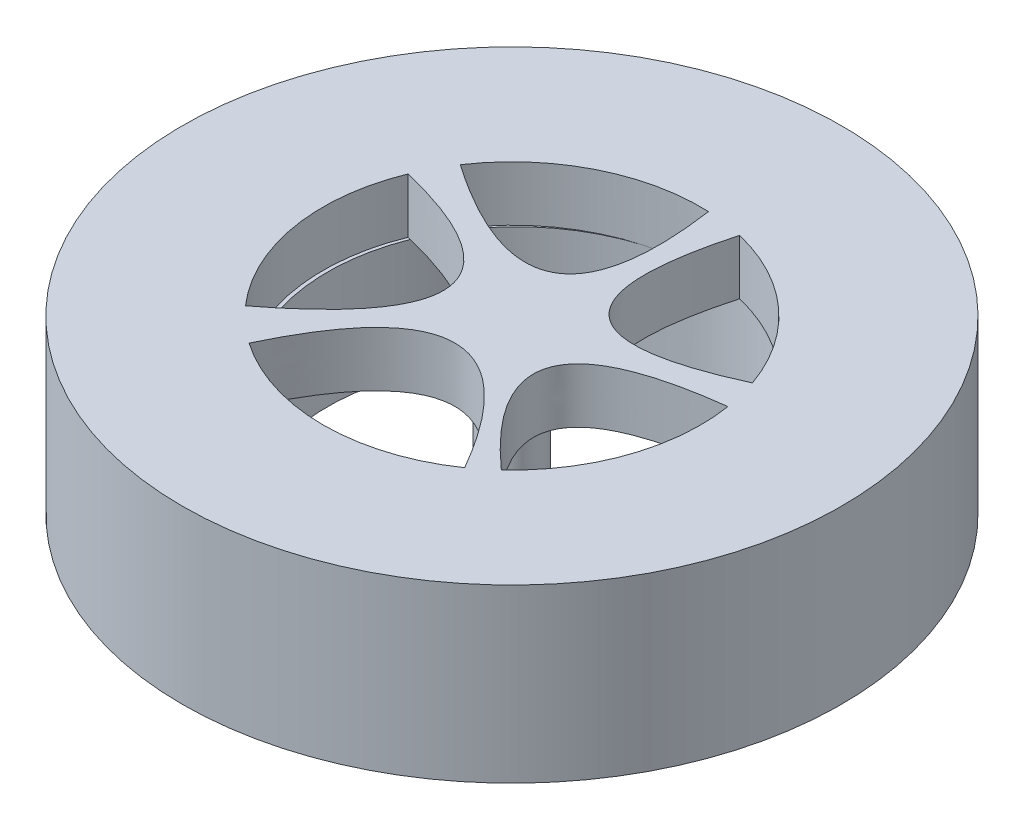
ISO-10303-21;
HEADER;
FILE_DESCRIPTION(('STEP AP214'),'2;1');
FILE_NAME('part.step','',(''),(''),'','','');
FILE_SCHEMA(('AUTOMOTIVE_DESIGN { 1 0 10303 214 1 1 1 1 }'));
ENDSEC;
DATA;
#1=APPLICATION_CONTEXT('core data for automotive mechanical design processes');
#2=APPLICATION_PROTOCOL_DEFINITION('international standard','automotive_design',2000,#1);
#3=PRODUCT_CONTEXT('',#1,'mechanical');
#4=PRODUCT('Part','Part','',(#3));
#5=PRODUCT_RELATED_PRODUCT_CATEGORY('part','',(#4));
#6=PRODUCT_DEFINITION_FORMATION('','',#4);
#7=PRODUCT_DEFINITION_CONTEXT('part definition',#1,'design');
#8=PRODUCT_DEFINITION('design','',#6,#7);
#9=PRODUCT_DEFINITION_SHAPE('','',#8);
#10=(LENGTH_UNIT() NAMED_UNIT(*) SI_UNIT(.MILLI.,.METRE.));
#11=(NAMED_UNIT(*) PLANE_ANGLE_UNIT() SI_UNIT($,.RADIAN.));
#12=(NAMED_UNIT(*) SI_UNIT($,.STERADIAN.) SOLID_ANGLE_UNIT());
#13=UNCERTAINTY_MEASURE_WITH_UNIT(LENGTH_MEASURE(1.E-05),#10,'distance_accuracy_value','');
#14=(GEOMETRIC_REPRESENTATION_CONTEXT(3) GLOBAL_UNCERTAINTY_ASSIGNED_CONTEXT((#13)) GLOBAL_UNIT_ASSIGNED_CONTEXT((#10,
#11,#12)) REPRESENTATION_CONTEXT('',''));
#15=CARTESIAN_POINT('',(0.,0.,0.));
#16=DIRECTION('',(0.,0.,1.));
#17=DIRECTION('',(1.,0.,0.));
#18=AXIS2_PLACEMENT_3D('',#15,#16,#17);
#19=CARTESIAN_POINT('',(-41.8687172900774,25.,-18.1249858398604));
#20=DIRECTION('',(0.,1.,0.));
#21=DIRECTION('',(0.,0.,1.));
#22=AXIS2_PLACEMENT_3D('',#19,#20,#21);
#23=PLANE('',#22);
#24=CARTESIAN_POINT('',(-57.5825730197563,25.,4.44323823973522));
#25=CARTESIAN_POINT('',(-43.3824366602649,25.,-25.570584631916));
#26=CARTESIAN_POINT('',(-26.1744695166798,25.,4.45687827334351));
#27=B_SPLINE_CURVE_WITH_KNOTS('',2,(#24,#25,#26),.UNSPECIFIED.,.F.,.F.,(3,3),(0.,1.),.UNSPECIFIED.);
#28=CARTESIAN_POINT('',(-57.5825730197563,25.,4.44323823973522));
#29=VERTEX_POINT('',#28);
#30=CARTESIAN_POINT('',(-26.1744695166798,25.,4.45687827334351));
#31=VERTEX_POINT('',#30);
#32=EDGE_CURVE('E60',#29,#31,#27,.T.);
#33=ORIENTED_EDGE('',*,*,#32,.T.);
#34=CARTESIAN_POINT('',(-41.8687172900774,25.,-18.1249858398604));
#35=DIRECTION('',(0.,-1.,0.));
#36=DIRECTION('',(0.,0.,-1.));
#37=AXIS2_PLACEMENT_3D('',#34,#35,#36);
#38=CIRCLE('',#37,27.5);
#39=EDGE_CURVE('E232',#31,#29,#38,.T.);
#40=ORIENTED_EDGE('',*,*,#39,.T.);
#41=EDGE_LOOP('',(#33,#40));
#42=FACE_BOUND('',#41,.T.);
#43=CARTESIAN_POINT('',(-67.3465288078325,25.,-28.4754022694415));
#44=CARTESIAN_POINT('',(-35.3604220946897,25.,-20.710055244798));
#45=CARTESIAN_POINT('',(-62.5504698344064,25.,0.));
#46=B_SPLINE_CURVE_WITH_KNOTS('',2,(#43,#44,#45),.UNSPECIFIED.,.F.,.F.,(3,3),(0.,1.),.UNSPECIFIED.);
#47=CARTESIAN_POINT('',(-67.3465288078325,25.,-28.4754022694415));
#48=VERTEX_POINT('',#47);
#49=CARTESIAN_POINT('',(-62.5504698344064,25.,0.));
#50=VERTEX_POINT('',#49);
#51=EDGE_CURVE('E68',#48,#50,#46,.T.);
#52=ORIENTED_EDGE('',*,*,#51,.T.);
#53=CARTESIAN_POINT('',(-41.8687172900774,25.,-18.1249858398604));
#54=DIRECTION('',(0.,-1.,0.));
#55=DIRECTION('',(0.,0.,-1.));
#56=AXIS2_PLACEMENT_3D('',#53,#54,#55);
#57=CIRCLE('',#56,27.5);
#58=EDGE_CURVE('E263',#50,#48,#57,.T.);
#59=ORIENTED_EDGE('',*,*,#58,.T.);
#60=EDGE_LOOP('',(#52,#59));
#61=FACE_BOUND('',#60,.T.);
#62=CARTESIAN_POINT('',(-15.9046301156076,25.,-27.1867835200413));
#63=CARTESIAN_POINT('',(-43.8764072157556,25.,-14.3288854530501));
#64=CARTESIAN_POINT('',(-35.4539369714029,25.,-44.8663506790593));
#65=B_SPLINE_CURVE_WITH_KNOTS('',2,(#62,#63,#64),.UNSPECIFIED.,.F.,.F.,(3,3),(0.,1.),.UNSPECIFIED.);
#66=CARTESIAN_POINT('',(-15.9046301156076,25.,-27.1867835200413));
#67=VERTEX_POINT('',#66);
#68=CARTESIAN_POINT('',(-35.4539369714029,25.,-44.8663506790593));
#69=VERTEX_POINT('',#68);
#70=EDGE_CURVE('E144',#67,#69,#65,.T.);
#71=ORIENTED_EDGE('',*,*,#70,.T.);
#72=CARTESIAN_POINT('',(-41.8687172900774,25.,-18.1249858398604));
#73=DIRECTION('',(0.,-1.,0.));
#74=DIRECTION('',(0.,0.,-1.));
#75=AXIS2_PLACEMENT_3D('',#72,#73,#74);
#76=CIRCLE('',#75,27.5);
#77=EDGE_CURVE('E153',#69,#67,#76,.T.);
#78=ORIENTED_EDGE('',*,*,#77,.T.);
#79=EDGE_LOOP('',(#71,#78));
#80=FACE_BOUND('',#79,.T.);
#81=CARTESIAN_POINT('',(-23.2105461945888,25.,2.07705988257761));
#82=CARTESIAN_POINT('',(-46.3557234271616,25.,-18.5464906730606));
#83=CARTESIAN_POINT('',(-14.7063699802523,25.,-22.4211339542111));
#84=B_SPLINE_CURVE_WITH_KNOTS('',2,(#81,#82,#83),.UNSPECIFIED.,.F.,.F.,(3,3),(0.,1.),.UNSPECIFIED.);
#85=CARTESIAN_POINT('',(-23.2105461945888,25.,2.07705988257762));
#86=VERTEX_POINT('',#85);
#87=CARTESIAN_POINT('',(-14.7063699802523,25.,-22.4211339542111));
#88=VERTEX_POINT('',#87);
#89=EDGE_CURVE('E193',#86,#88,#84,.T.);
#90=ORIENTED_EDGE('',*,*,#89,.T.);
#91=CARTESIAN_POINT('',(-41.8687172900774,25.,-18.1249858398604));
#92=DIRECTION('',(0.,-1.,0.));
#93=DIRECTION('',(0.,0.,-1.));
#94=AXIS2_PLACEMENT_3D('',#91,#92,#93);
#95=CIRCLE('',#94,27.5);
#96=EDGE_CURVE('E200',#88,#86,#95,.T.);
#97=ORIENTED_EDGE('',*,*,#96,.T.);
#98=EDGE_LOOP('',(#90,#97));
#99=FACE_BOUND('',#98,.T.);
#100=CARTESIAN_POINT('',(-40.7178815858433,25.,-45.6008948727178));
#101=CARTESIAN_POINT('',(-36.1565237836162,25.,-13.602103874753));
#102=CARTESIAN_POINT('',(-64.7073949398779,25.,-33.4431059336742));
#103=B_SPLINE_CURVE_WITH_KNOTS('',2,(#100,#101,#102),.UNSPECIFIED.,.F.,.F.,(3,3),(0.,1.),.UNSPECIFIED.);
#104=CARTESIAN_POINT('',(-40.7178815858433,25.,-45.6008948727178));
#105=VERTEX_POINT('',#104);
#106=CARTESIAN_POINT('',(-64.7073949398779,25.,-33.4431059336742));
#107=VERTEX_POINT('',#106);
#108=EDGE_CURVE('E293',#105,#107,#103,.T.);
#109=ORIENTED_EDGE('',*,*,#108,.T.);
#110=CARTESIAN_POINT('',(-41.8687172900774,25.,-18.1249858398604));
#111=DIRECTION('',(0.,-1.,0.));
#112=DIRECTION('',(0.,0.,-1.));
#113=AXIS2_PLACEMENT_3D('',#110,#111,#112);
#114=CIRCLE('',#113,27.5);
#115=EDGE_CURVE('E300',#107,#105,#114,.T.);
#116=ORIENTED_EDGE('',*,*,#115,.T.);
#117=EDGE_LOOP('',(#109,#116));
#118=FACE_BOUND('',#117,.T.);
#119=CARTESIAN_POINT('',(-41.8687172900774,25.,-18.1249858398604));
#120=DIRECTION('',(0.,1.,0.));
#121=DIRECTION('',(0.,0.,1.));
#122=AXIS2_PLACEMENT_3D('',#119,#120,#121);
#123=CIRCLE('',#122,48.);
#124=CARTESIAN_POINT('',(-41.8687172900774,25.,29.8750141601397));
#125=VERTEX_POINT('',#124);
#126=EDGE_CURVE('E396',#125,#125,#123,.T.);
#127=ORIENTED_EDGE('',*,*,#126,.T.);
#128=EDGE_LOOP('',(#127));
#129=FACE_BOUND('',#128,.T.);
#130=ADVANCED_FACE('F41',(#42,#61,#80,#99,#118,#129),#23,.T.);
#131=CARTESIAN_POINT('',(-41.8687172900774,0.,-18.1249858398604));
#132=DIRECTION('',(0.,1.,0.));
#133=DIRECTION('',(0.,0.,1.));
#134=AXIS2_PLACEMENT_3D('',#131,#132,#133);
#135=PLANE('',#134);
#136=CARTESIAN_POINT('',(-41.3457524589158,0.,-18.2744043630493));
#137=DIRECTION('',(0.,-1.,0.));
#138=DIRECTION('',(0.,0.,-1.));
#139=AXIS2_PLACEMENT_3D('',#136,#137,#138);
#140=CIRCLE('',#139,27.5);
#141=CARTESIAN_POINT('',(-41.3457524589158,0.,-45.7744043630493));
#142=VERTEX_POINT('',#141);
#143=EDGE_CURVE('E45',#142,#142,#140,.T.);
#144=ORIENTED_EDGE('',*,*,#143,.F.);
#145=EDGE_LOOP('',(#144));
#146=FACE_BOUND('',#145,.T.);
#147=CARTESIAN_POINT('',(-41.8687172900774,0.,-18.1249858398604));
#148=DIRECTION('',(0.,1.,0.));
#149=DIRECTION('',(0.,0.,1.));
#150=AXIS2_PLACEMENT_3D('',#147,#148,#149);
#151=CIRCLE('',#150,48.);
#152=CARTESIAN_POINT('',(-41.8687172900774,0.,29.8750141601397));
#153=VERTEX_POINT('',#152);
#154=EDGE_CURVE('E393',#153,#153,#151,.T.);
#155=ORIENTED_EDGE('',*,*,#154,.F.);
#156=EDGE_LOOP('',(#155));
#157=FACE_BOUND('',#156,.T.);
#158=ADVANCED_FACE('F43',(#146,#157),#135,.F.);
#159=CARTESIAN_POINT('',(-41.3457524589158,17.,-18.2744043630493));
#160=DIRECTION('',(0.,-1.,0.));
#161=DIRECTION('',(0.,0.,-1.));
#162=AXIS2_PLACEMENT_3D('',#159,#160,#161);
#163=CYLINDRICAL_SURFACE('',#162,27.5);
#164=CARTESIAN_POINT('',(-41.3457524589158,17.,-18.2744043630493));
#165=DIRECTION('',(0.,-1.,0.));
#166=DIRECTION('',(0.,0.,-1.));
#167=AXIS2_PLACEMENT_3D('',#164,#165,#166);
#168=CIRCLE('',#167,27.5);
#169=CARTESIAN_POINT('',(-34.0527732640102,17.,8.2409205352557));
#170=VERTEX_POINT('',#169);
#171=CARTESIAN_POINT('',(-57.3974563398632,17.,4.05478734911044));
#172=VERTEX_POINT('',#171);
#173=EDGE_CURVE('E355',#170,#172,#168,.T.);
#174=ORIENTED_EDGE('',*,*,#173,.F.);
#175=CARTESIAN_POINT('',(-49.1616964849826,17.,-44.6403107381655));
#176=VERTEX_POINT('',#175);
#177=EDGE_CURVE('E354',#176,#170,#168,.T.);
#178=ORIENTED_EDGE('',*,*,#177,.F.);
#179=CARTESIAN_POINT('',(-64.4160583896701,17.,-33.2414008640646));
#180=VERTEX_POINT('',#179);
#181=EDGE_CURVE('E351',#180,#176,#168,.T.);
#182=ORIENTED_EDGE('',*,*,#181,.F.);
#183=CARTESIAN_POINT('',(-66.9248817992793,17.,-28.37183681833));
#184=VERTEX_POINT('',#183);
#185=EDGE_CURVE('E338',#184,#180,#168,.T.);
#186=ORIENTED_EDGE('',*,*,#185,.F.);
#187=CARTESIAN_POINT('',(-62.1586347098584,17.,-0.300146870501505));
#188=VERTEX_POINT('',#187);
#189=EDGE_CURVE('E331',#188,#184,#168,.T.);
#190=ORIENTED_EDGE('',*,*,#189,.F.);
#191=EDGE_CURVE('E337',#172,#188,#168,.T.);
#192=ORIENTED_EDGE('',*,*,#191,.F.);
#193=EDGE_LOOP('',(#174,#178,#182,#186,#190,#192));
#194=FACE_BOUND('',#193,.T.);
#195=ORIENTED_EDGE('',*,*,#143,.T.);
#196=EDGE_LOOP('',(#195));
#197=FACE_BOUND('',#196,.T.);
#198=ADVANCED_FACE('F313',(#194,#197),#163,.F.);
#199=CARTESIAN_POINT('',(-41.3457524589158,17.,-18.2744043630493));
#200=DIRECTION('',(0.,-1.,0.));
#201=DIRECTION('',(0.,0.,-1.));
#202=AXIS2_PLACEMENT_3D('',#199,#200,#201);
#203=PLANE('',#202);
#204=CARTESIAN_POINT('',(-41.8687172900774,17.,-18.1249858398604));
#205=DIRECTION('',(0.,-1.,0.));
#206=DIRECTION('',(0.,0.,-1.));
#207=AXIS2_PLACEMENT_3D('',#204,#205,#206);
#208=CIRCLE('',#207,4.00000000000001);
#209=CARTESIAN_POINT('',(-41.8687172900774,17.,-22.1249858398604));
#210=VERTEX_POINT('',#209);
#211=EDGE_CURVE('E170',#210,#210,#208,.T.);
#212=ORIENTED_EDGE('',*,*,#211,.F.);
#213=EDGE_LOOP('',(#212));
#214=FACE_BOUND('',#213,.T.);
#215=CARTESIAN_POINT('',(-57.5825730197563,17.,4.44323823973522));
#216=CARTESIAN_POINT('',(-43.3824366602649,17.,-25.570584631916));
#217=CARTESIAN_POINT('',(-26.1744695166798,17.,4.45687827334351));
#218=B_SPLINE_CURVE_WITH_KNOTS('',2,(#215,#216,#217),.UNSPECIFIED.,.F.,.F.,(3,3),(0.,1.),.UNSPECIFIED.);
#219=CARTESIAN_POINT('',(-26.1744695166798,17.,4.45687827334351));
#220=VERTEX_POINT('',#219);
#221=EDGE_CURVE('E11',#172,#220,#218,.T.);
#222=ORIENTED_EDGE('',*,*,#221,.F.);
#223=ORIENTED_EDGE('',*,*,#191,.T.);
#224=CARTESIAN_POINT('',(-67.3465288078325,17.,-28.4754022694415));
#225=CARTESIAN_POINT('',(-35.3604220946897,17.,-20.710055244798));
#226=CARTESIAN_POINT('',(-62.5504698344064,17.,0.));
#227=B_SPLINE_CURVE_WITH_KNOTS('',2,(#224,#225,#226),.UNSPECIFIED.,.F.,.F.,(3,3),(0.,1.),.UNSPECIFIED.);
#228=EDGE_CURVE('E51',#184,#188,#227,.T.);
#229=ORIENTED_EDGE('',*,*,#228,.F.);
#230=ORIENTED_EDGE('',*,*,#185,.T.);
#231=CARTESIAN_POINT('',(-40.7178815858433,17.,-45.6008948727178));
#232=CARTESIAN_POINT('',(-36.1565237836162,17.,-13.602103874753));
#233=CARTESIAN_POINT('',(-64.7073949398779,17.,-33.4431059336742));
#234=B_SPLINE_CURVE_WITH_KNOTS('',2,(#231,#232,#233),.UNSPECIFIED.,.F.,.F.,(3,3),(0.,1.),.UNSPECIFIED.);
#235=CARTESIAN_POINT('',(-40.7178815858433,17.,-45.6008948727178));
#236=VERTEX_POINT('',#235);
#237=EDGE_CURVE('E367',#236,#180,#234,.T.);
#238=ORIENTED_EDGE('',*,*,#237,.F.);
#239=CARTESIAN_POINT('',(-41.8687172900774,17.,-18.1249858398604));
#240=DIRECTION('',(0.,-1.,0.));
#241=DIRECTION('',(0.,0.,-1.));
#242=AXIS2_PLACEMENT_3D('',#239,#240,#241);
#243=CIRCLE('',#242,27.5);
#244=EDGE_CURVE('E345',#176,#236,#243,.T.);
#245=ORIENTED_EDGE('',*,*,#244,.F.);
#246=ORIENTED_EDGE('',*,*,#177,.T.);
#247=CARTESIAN_POINT('',(-41.8687172900774,17.,-18.1249858398604));
#248=DIRECTION('',(0.,-1.,0.));
#249=DIRECTION('',(0.,0.,-1.));
#250=AXIS2_PLACEMENT_3D('',#247,#248,#249);
#251=CIRCLE('',#250,27.5);
#252=EDGE_CURVE('E233',#220,#170,#251,.T.);
#253=ORIENTED_EDGE('',*,*,#252,.F.);
#254=EDGE_LOOP('',(#222,#223,#229,#230,#238,#245,#246,#253));
#255=FACE_BOUND('',#254,.T.);
#256=CARTESIAN_POINT('',(-15.9046301156076,17.,-27.1867835200413));
#257=CARTESIAN_POINT('',(-43.8764072157556,17.,-14.3288854530501));
#258=CARTESIAN_POINT('',(-35.4539369714029,17.,-44.8663506790593));
#259=B_SPLINE_CURVE_WITH_KNOTS('',2,(#256,#257,#258),.UNSPECIFIED.,.F.,.F.,(3,3),(0.,1.),.UNSPECIFIED.);
#260=CARTESIAN_POINT('',(-15.9046301156076,17.,-27.1867835200413));
#261=VERTEX_POINT('',#260);
#262=CARTESIAN_POINT('',(-35.4539369714029,17.,-44.8663506790593));
#263=VERTEX_POINT('',#262);
#264=EDGE_CURVE('E147',#261,#263,#259,.T.);
#265=ORIENTED_EDGE('',*,*,#264,.F.);
#266=CARTESIAN_POINT('',(-41.8687172900774,17.,-18.1249858398604));
#267=DIRECTION('',(0.,-1.,0.));
#268=DIRECTION('',(0.,0.,-1.));
#269=AXIS2_PLACEMENT_3D('',#266,#267,#268);
#270=CIRCLE('',#269,27.5);
#271=EDGE_CURVE('E162',#263,#261,#270,.T.);
#272=ORIENTED_EDGE('',*,*,#271,.F.);
#273=EDGE_LOOP('',(#265,#272));
#274=FACE_BOUND('',#273,.T.);
#275=CARTESIAN_POINT('',(-23.2105461945888,17.,2.07705988257761));
#276=CARTESIAN_POINT('',(-46.3557234271616,17.,-18.5464906730606));
#277=CARTESIAN_POINT('',(-14.7063699802523,17.,-22.4211339542111));
#278=B_SPLINE_CURVE_WITH_KNOTS('',2,(#275,#276,#277),.UNSPECIFIED.,.F.,.F.,(3,3),(0.,1.),.UNSPECIFIED.);
#279=CARTESIAN_POINT('',(-23.2105461945888,17.,2.07705988257762));
#280=VERTEX_POINT('',#279);
#281=CARTESIAN_POINT('',(-14.7063699802523,17.,-22.4211339542111));
#282=VERTEX_POINT('',#281);
#283=EDGE_CURVE('E210',#280,#282,#278,.T.);
#284=ORIENTED_EDGE('',*,*,#283,.F.);
#285=CARTESIAN_POINT('',(-41.8687172900774,17.,-18.1249858398604));
#286=DIRECTION('',(0.,-1.,0.));
#287=DIRECTION('',(0.,0.,-1.));
#288=AXIS2_PLACEMENT_3D('',#285,#286,#287);
#289=CIRCLE('',#288,27.5);
#290=EDGE_CURVE('E201',#282,#280,#289,.T.);
#291=ORIENTED_EDGE('',*,*,#290,.F.);
#292=EDGE_LOOP('',(#284,#291));
#293=FACE_BOUND('',#292,.T.);
#294=ADVANCED_FACE('F189',(#214,#255,#274,#293),#203,.T.);
#295=DIRECTION('',(0.,-1.,0.));
#296=VECTOR('',#295,1.);
#297=SURFACE_OF_LINEAR_EXTRUSION('',#84,#296);
#298=ORIENTED_EDGE('',*,*,#283,.T.);
#299=DIRECTION('',(0.,-1.,0.));
#300=VECTOR('',#299,1.);
#301=CARTESIAN_POINT('',(-14.7063699802523,25.,-22.4211339542111));
#302=LINE('',#301,#300);
#303=EDGE_CURVE('E209',#88,#282,#302,.T.);
#304=ORIENTED_EDGE('',*,*,#303,.F.);
#305=ORIENTED_EDGE('',*,*,#89,.F.);
#306=DIRECTION('',(0.,-1.,0.));
#307=VECTOR('',#306,1.);
#308=CARTESIAN_POINT('',(-23.2105461945888,25.,2.07705988257762));
#309=LINE('',#308,#307);
#310=EDGE_CURVE('E221',#86,#280,#309,.T.);
#311=ORIENTED_EDGE('',*,*,#310,.T.);
#312=EDGE_LOOP('',(#298,#304,#305,#311));
#313=FACE_BOUND('',#312,.T.);
#314=ADVANCED_FACE('F184',(#313),#297,.F.);
#315=CARTESIAN_POINT('',(-41.8687172900774,25.,-18.1249858398604));
#316=DIRECTION('',(0.,-1.,0.));
#317=DIRECTION('',(0.,0.,-1.));
#318=AXIS2_PLACEMENT_3D('',#315,#316,#317);
#319=CYLINDRICAL_SURFACE('',#318,27.5);
#320=ORIENTED_EDGE('',*,*,#290,.T.);
#321=ORIENTED_EDGE('',*,*,#310,.F.);
#322=ORIENTED_EDGE('',*,*,#96,.F.);
#323=ORIENTED_EDGE('',*,*,#303,.T.);
#324=EDGE_LOOP('',(#320,#321,#322,#323));
#325=FACE_BOUND('',#324,.T.);
#326=ADVANCED_FACE('F180',(#325),#319,.F.);
#327=DIRECTION('',(0.,-1.,0.));
#328=VECTOR('',#327,1.);
#329=SURFACE_OF_LINEAR_EXTRUSION('',#65,#328);
#330=ORIENTED_EDGE('',*,*,#264,.T.);
#331=DIRECTION('',(0.,-1.,0.));
#332=VECTOR('',#331,1.);
#333=CARTESIAN_POINT('',(-35.4539369714029,25.,-44.8663506790593));
#334=LINE('',#333,#332);
#335=EDGE_CURVE('E140',#69,#263,#334,.T.);
#336=ORIENTED_EDGE('',*,*,#335,.F.);
#337=ORIENTED_EDGE('',*,*,#70,.F.);
#338=DIRECTION('',(0.,-1.,0.));
#339=VECTOR('',#338,1.);
#340=CARTESIAN_POINT('',(-15.9046301156076,25.,-27.1867835200413));
#341=LINE('',#340,#339);
#342=EDGE_CURVE('E152',#67,#261,#341,.T.);
#343=ORIENTED_EDGE('',*,*,#342,.T.);
#344=EDGE_LOOP('',(#330,#336,#337,#343));
#345=FACE_BOUND('',#344,.T.);
#346=ADVANCED_FACE('F142',(#345),#329,.F.);
#347=CARTESIAN_POINT('',(-41.8687172900774,25.,-18.1249858398604));
#348=DIRECTION('',(0.,-1.,0.));
#349=DIRECTION('',(0.,0.,-1.));
#350=AXIS2_PLACEMENT_3D('',#347,#348,#349);
#351=CYLINDRICAL_SURFACE('',#350,27.5);
#352=ORIENTED_EDGE('',*,*,#271,.T.);
#353=ORIENTED_EDGE('',*,*,#342,.F.);
#354=ORIENTED_EDGE('',*,*,#77,.F.);
#355=ORIENTED_EDGE('',*,*,#335,.T.);
#356=EDGE_LOOP('',(#352,#353,#354,#355));
#357=FACE_BOUND('',#356,.T.);
#358=ADVANCED_FACE('F156',(#357),#351,.F.);
#359=CARTESIAN_POINT('',(-44.4345810232384,17.,-26.5620521389745));
#360=DIRECTION('',(0.,1.,0.));
#361=DIRECTION('',(0.,0.,1.));
#362=AXIS2_PLACEMENT_3D('',#359,#360,#361);
#363=PLANE('',#362);
#364=ORIENTED_EDGE('',*,*,#181,.T.);
#365=CARTESIAN_POINT('',(-64.7073949398779,17.,-33.4431059336742));
#366=VERTEX_POINT('',#365);
#367=EDGE_CURVE('E301',#366,#176,#243,.T.);
#368=ORIENTED_EDGE('',*,*,#367,.F.);
#369=EDGE_CURVE('E289',#180,#366,#234,.T.);
#370=ORIENTED_EDGE('',*,*,#369,.F.);
#371=EDGE_LOOP('',(#364,#368,#370));
#372=FACE_BOUND('',#371,.T.);
#373=ADVANCED_FACE('F255',(#372),#363,.T.);
#374=DIRECTION('',(0.,-1.,0.));
#375=VECTOR('',#374,1.);
#376=SURFACE_OF_LINEAR_EXTRUSION('',#103,#375);
#377=ORIENTED_EDGE('',*,*,#237,.T.);
#378=ORIENTED_EDGE('',*,*,#369,.T.);
#379=DIRECTION('',(0.,-1.,0.));
#380=VECTOR('',#379,1.);
#381=CARTESIAN_POINT('',(-64.7073949398779,25.,-33.4431059336742));
#382=LINE('',#381,#380);
#383=EDGE_CURVE('E358',#107,#366,#382,.T.);
#384=ORIENTED_EDGE('',*,*,#383,.F.);
#385=ORIENTED_EDGE('',*,*,#108,.F.);
#386=DIRECTION('',(0.,-1.,0.));
#387=VECTOR('',#386,1.);
#388=CARTESIAN_POINT('',(-40.7178815858433,25.,-45.6008948727178));
#389=LINE('',#388,#387);
#390=EDGE_CURVE('E362',#105,#236,#389,.T.);
#391=ORIENTED_EDGE('',*,*,#390,.T.);
#392=EDGE_LOOP('',(#377,#378,#384,#385,#391));
#393=FACE_BOUND('',#392,.T.);
#394=ADVANCED_FACE('F307',(#393),#376,.F.);
#395=CARTESIAN_POINT('',(-41.8687172900774,25.,-18.1249858398604));
#396=DIRECTION('',(0.,-1.,0.));
#397=DIRECTION('',(0.,0.,-1.));
#398=AXIS2_PLACEMENT_3D('',#395,#396,#397);
#399=CYLINDRICAL_SURFACE('',#398,27.5);
#400=ORIENTED_EDGE('',*,*,#367,.T.);
#401=ORIENTED_EDGE('',*,*,#244,.T.);
#402=ORIENTED_EDGE('',*,*,#390,.F.);
#403=ORIENTED_EDGE('',*,*,#115,.F.);
#404=ORIENTED_EDGE('',*,*,#383,.T.);
#405=EDGE_LOOP('',(#400,#401,#402,#403,#404));
#406=FACE_BOUND('',#405,.T.);
#407=ADVANCED_FACE('F246',(#406),#399,.F.);
#408=CARTESIAN_POINT('',(-50.1544607079046,17.,-17.4738781897594));
#409=DIRECTION('',(0.,1.,0.));
#410=DIRECTION('',(0.,0.,1.));
#411=AXIS2_PLACEMENT_3D('',#408,#409,#410);
#412=PLANE('',#411);
#413=ORIENTED_EDGE('',*,*,#189,.T.);
#414=CARTESIAN_POINT('',(-67.3465288078325,17.,-28.4754022694415));
#415=VERTEX_POINT('',#414);
#416=EDGE_CURVE('E274',#415,#184,#227,.T.);
#417=ORIENTED_EDGE('',*,*,#416,.F.);
#418=CARTESIAN_POINT('',(-41.8687172900774,17.,-18.1249858398604));
#419=DIRECTION('',(0.,-1.,0.));
#420=DIRECTION('',(0.,0.,-1.));
#421=AXIS2_PLACEMENT_3D('',#418,#419,#420);
#422=CIRCLE('',#421,27.5);
#423=CARTESIAN_POINT('',(-62.5504698344064,17.,0.));
#424=VERTEX_POINT('',#423);
#425=EDGE_CURVE('E264',#424,#415,#422,.T.);
#426=ORIENTED_EDGE('',*,*,#425,.F.);
#427=EDGE_CURVE('E279',#188,#424,#227,.T.);
#428=ORIENTED_EDGE('',*,*,#427,.F.);
#429=EDGE_LOOP('',(#413,#417,#426,#428));
#430=FACE_BOUND('',#429,.T.);
#431=ADVANCED_FACE('F242',(#430),#412,.T.);
#432=DIRECTION('',(0.,-1.,0.));
#433=VECTOR('',#432,1.);
#434=SURFACE_OF_LINEAR_EXTRUSION('',#46,#433);
#435=ORIENTED_EDGE('',*,*,#416,.T.);
#436=ORIENTED_EDGE('',*,*,#228,.T.);
#437=ORIENTED_EDGE('',*,*,#427,.T.);
#438=DIRECTION('',(0.,-1.,0.));
#439=VECTOR('',#438,1.);
#440=CARTESIAN_POINT('',(-62.5504698344064,25.,0.));
#441=LINE('',#440,#439);
#442=EDGE_CURVE('E273',#50,#424,#441,.T.);
#443=ORIENTED_EDGE('',*,*,#442,.F.);
#444=ORIENTED_EDGE('',*,*,#51,.F.);
#445=DIRECTION('',(0.,-1.,0.));
#446=VECTOR('',#445,1.);
#447=CARTESIAN_POINT('',(-67.3465288078325,25.,-28.4754022694415));
#448=LINE('',#447,#446);
#449=EDGE_CURVE('E286',#48,#415,#448,.T.);
#450=ORIENTED_EDGE('',*,*,#449,.T.);
#451=EDGE_LOOP('',(#435,#436,#437,#443,#444,#450));
#452=FACE_BOUND('',#451,.T.);
#453=ADVANCED_FACE('F245',(#452),#434,.F.);
#454=CARTESIAN_POINT('',(-41.8687172900774,25.,-18.1249858398604));
#455=DIRECTION('',(0.,-1.,0.));
#456=DIRECTION('',(0.,0.,-1.));
#457=AXIS2_PLACEMENT_3D('',#454,#455,#456);
#458=CYLINDRICAL_SURFACE('',#457,27.5);
#459=ORIENTED_EDGE('',*,*,#425,.T.);
#460=ORIENTED_EDGE('',*,*,#449,.F.);
#461=ORIENTED_EDGE('',*,*,#58,.F.);
#462=ORIENTED_EDGE('',*,*,#442,.T.);
#463=EDGE_LOOP('',(#459,#460,#461,#462));
#464=FACE_BOUND('',#463,.T.);
#465=ADVANCED_FACE('F248',(#464),#458,.F.);
#466=CARTESIAN_POINT('',(-42.6304789642415,17.,-10.5602631876883));
#467=DIRECTION('',(0.,1.,0.));
#468=DIRECTION('',(0.,0.,1.));
#469=AXIS2_PLACEMENT_3D('',#466,#467,#468);
#470=PLANE('',#469);
#471=ORIENTED_EDGE('',*,*,#173,.T.);
#472=CARTESIAN_POINT('',(-57.5825730197563,17.,4.44323823973522));
#473=VERTEX_POINT('',#472);
#474=EDGE_CURVE('E53',#473,#172,#218,.T.);
#475=ORIENTED_EDGE('',*,*,#474,.F.);
#476=EDGE_CURVE('E585',#170,#473,#251,.T.);
#477=ORIENTED_EDGE('',*,*,#476,.F.);
#478=EDGE_LOOP('',(#471,#475,#477));
#479=FACE_BOUND('',#478,.T.);
#480=ADVANCED_FACE('F191',(#479),#470,.T.);
#481=DIRECTION('',(0.,-1.,0.));
#482=VECTOR('',#481,1.);
#483=SURFACE_OF_LINEAR_EXTRUSION('',#27,#482);
#484=ORIENTED_EDGE('',*,*,#474,.T.);
#485=ORIENTED_EDGE('',*,*,#221,.T.);
#486=DIRECTION('',(0.,-1.,0.));
#487=VECTOR('',#486,1.);
#488=CARTESIAN_POINT('',(-26.1744695166798,25.,4.45687827334351));
#489=LINE('',#488,#487);
#490=EDGE_CURVE('E265',#31,#220,#489,.T.);
#491=ORIENTED_EDGE('',*,*,#490,.F.);
#492=ORIENTED_EDGE('',*,*,#32,.F.);
#493=DIRECTION('',(0.,-1.,0.));
#494=VECTOR('',#493,1.);
#495=CARTESIAN_POINT('',(-57.5825730197563,25.,4.44323823973522));
#496=LINE('',#495,#494);
#497=EDGE_CURVE('E587',#29,#473,#496,.T.);
#498=ORIENTED_EDGE('',*,*,#497,.T.);
#499=EDGE_LOOP('',(#484,#485,#491,#492,#498));
#500=FACE_BOUND('',#499,.T.);
#501=ADVANCED_FACE('F238',(#500),#483,.F.);
#502=CARTESIAN_POINT('',(-41.8687172900774,25.,-18.1249858398604));
#503=DIRECTION('',(0.,-1.,0.));
#504=DIRECTION('',(0.,0.,-1.));
#505=AXIS2_PLACEMENT_3D('',#502,#503,#504);
#506=CYLINDRICAL_SURFACE('',#505,27.5);
#507=ORIENTED_EDGE('',*,*,#252,.T.);
#508=ORIENTED_EDGE('',*,*,#476,.T.);
#509=ORIENTED_EDGE('',*,*,#497,.F.);
#510=ORIENTED_EDGE('',*,*,#39,.F.);
#511=ORIENTED_EDGE('',*,*,#490,.T.);
#512=EDGE_LOOP('',(#507,#508,#509,#510,#511));
#513=FACE_BOUND('',#512,.T.);
#514=ADVANCED_FACE('F241',(#513),#506,.F.);
#515=CARTESIAN_POINT('',(-41.8687172900774,-8.,-18.1249858398604));
#516=DIRECTION('',(0.,1.,0.));
#517=DIRECTION('',(0.,0.,1.));
#518=AXIS2_PLACEMENT_3D('',#515,#516,#517);
#519=CYLINDRICAL_SURFACE('',#518,4.00000000000001);
#520=CARTESIAN_POINT('',(-41.8687172900774,-8.,-18.1249858398604));
#521=DIRECTION('',(0.,-1.,0.));
#522=DIRECTION('',(0.,0.,-1.));
#523=AXIS2_PLACEMENT_3D('',#520,#521,#522);
#524=CIRCLE('',#523,4.00000000000001);
#525=CARTESIAN_POINT('',(-41.8687172900774,-8.,-22.1249858398604));
#526=VERTEX_POINT('',#525);
#527=EDGE_CURVE('E409',#526,#526,#524,.T.);
#528=ORIENTED_EDGE('',*,*,#527,.F.);
#529=EDGE_LOOP('',(#528));
#530=FACE_BOUND('',#529,.T.);
#531=ORIENTED_EDGE('',*,*,#211,.T.);
#532=EDGE_LOOP('',(#531));
#533=FACE_BOUND('',#532,.T.);
#534=ADVANCED_FACE('F419',(#530,#533),#519,.T.);
#535=CARTESIAN_POINT('',(-41.8687172900774,-8.,-18.1249858398604));
#536=DIRECTION('',(0.,-1.,0.));
#537=DIRECTION('',(0.,0.,-1.));
#538=AXIS2_PLACEMENT_3D('',#535,#536,#537);
#539=PLANE('',#538);
#540=CARTESIAN_POINT('',(-41.8687172900774,-8.,-18.1249858398604));
#541=DIRECTION('',(0.,-1.,0.));
#542=DIRECTION('',(0.,0.,-1.));
#543=AXIS2_PLACEMENT_3D('',#540,#541,#542);
#544=CIRCLE('',#543,2.5);
#545=CARTESIAN_POINT('',(-41.8687172900774,-8.,-20.6249858398604));
#546=VERTEX_POINT('',#545);
#547=EDGE_CURVE('E400',#546,#546,#544,.T.);
#548=ORIENTED_EDGE('',*,*,#547,.F.);
#549=EDGE_LOOP('',(#548));
#550=FACE_BOUND('',#549,.T.);
#551=ORIENTED_EDGE('',*,*,#527,.T.);
#552=EDGE_LOOP('',(#551));
#553=FACE_BOUND('',#552,.T.);
#554=ADVANCED_FACE('F421',(#550,#553),#539,.T.);
#555=CARTESIAN_POINT('',(-41.8687172900774,2.,-18.1249858398604));
#556=DIRECTION('',(0.,-1.,0.));
#557=DIRECTION('',(0.,0.,-1.));
#558=AXIS2_PLACEMENT_3D('',#555,#556,#557);
#559=CYLINDRICAL_SURFACE('',#558,2.5);
#560=CARTESIAN_POINT('',(-41.8687172900774,2.,-18.1249858398604));
#561=DIRECTION('',(0.,-1.,0.));
#562=DIRECTION('',(0.,0.,-1.));
#563=AXIS2_PLACEMENT_3D('',#560,#561,#562);
#564=CIRCLE('',#563,2.5);
#565=CARTESIAN_POINT('',(-41.8687172900774,2.,-20.6249858398604));
#566=VERTEX_POINT('',#565);
#567=EDGE_CURVE('E403',#566,#566,#564,.T.);
#568=ORIENTED_EDGE('',*,*,#567,.F.);
#569=EDGE_LOOP('',(#568));
#570=FACE_BOUND('',#569,.T.);
#571=ORIENTED_EDGE('',*,*,#547,.T.);
#572=EDGE_LOOP('',(#571));
#573=FACE_BOUND('',#572,.T.);
#574=ADVANCED_FACE('F427',(#570,#573),#559,.F.);
#575=CARTESIAN_POINT('',(-41.8687172900774,2.,-18.1249858398604));
#576=DIRECTION('',(0.,-1.,0.));
#577=DIRECTION('',(0.,0.,-1.));
#578=AXIS2_PLACEMENT_3D('',#575,#576,#577);
#579=PLANE('',#578);
#580=ORIENTED_EDGE('',*,*,#567,.T.);
#581=EDGE_LOOP('',(#580));
#582=FACE_BOUND('',#581,.T.);
#583=ADVANCED_FACE('F434',(#582),#579,.T.);
#584=CARTESIAN_POINT('',(-41.8687172900774,25.,-18.1249858398604));
#585=DIRECTION('',(0.,-1.,0.));
#586=DIRECTION('',(0.,0.,-1.));
#587=AXIS2_PLACEMENT_3D('',#584,#585,#586);
#588=CYLINDRICAL_SURFACE('',#587,48.);
#589=ORIENTED_EDGE('',*,*,#126,.F.);
#590=EDGE_LOOP('',(#589));
#591=FACE_BOUND('',#590,.T.);
#592=ORIENTED_EDGE('',*,*,#154,.T.);
#593=EDGE_LOOP('',(#592));
#594=FACE_BOUND('',#593,.T.);
#595=ADVANCED_FACE('F438',(#591,#594),#588,.T.);
#596=CLOSED_SHELL('',(#130,#158,#198,#294,#314,#326,#346,#358,#373,#394,#407,#431,#453,#465,
#480,#501,#514,#534,#554,#574,#583,#595));
#597=MANIFOLD_SOLID_BREP('B2',#596);
#598=ADVANCED_BREP_SHAPE_REPRESENTATION('',(#18,#597),#14);
#599=SHAPE_DEFINITION_REPRESENTATION(#9,#598);
ENDSEC;
END-ISO-10303-21;
